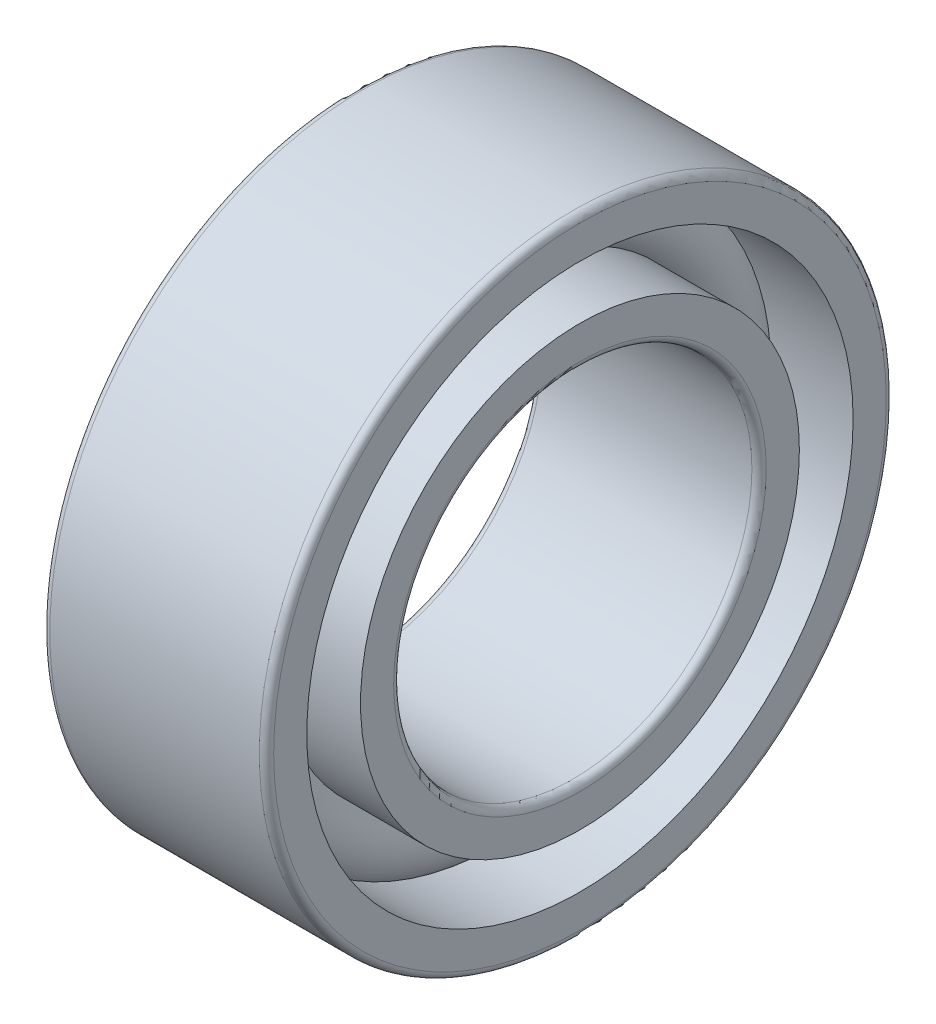
ISO-10303-21;
HEADER;
FILE_DESCRIPTION(('STEP AP214'),'2;1');
FILE_NAME('part.step','',(''),(''),'','','');
FILE_SCHEMA(('AUTOMOTIVE_DESIGN { 1 0 10303 214 1 1 1 1 }'));
ENDSEC;
DATA;
#1=APPLICATION_CONTEXT('core data for automotive mechanical design processes');
#2=APPLICATION_PROTOCOL_DEFINITION('international standard','automotive_design',2000,#1);
#3=PRODUCT_CONTEXT('',#1,'mechanical');
#4=PRODUCT('Part','Part','',(#3));
#5=PRODUCT_RELATED_PRODUCT_CATEGORY('part','',(#4));
#6=PRODUCT_DEFINITION_FORMATION('','',#4);
#7=PRODUCT_DEFINITION_CONTEXT('part definition',#1,'design');
#8=PRODUCT_DEFINITION('design','',#6,#7);
#9=PRODUCT_DEFINITION_SHAPE('','',#8);
#10=(LENGTH_UNIT() NAMED_UNIT(*) SI_UNIT(.MILLI.,.METRE.));
#11=(NAMED_UNIT(*) PLANE_ANGLE_UNIT() SI_UNIT($,.RADIAN.));
#12=(NAMED_UNIT(*) SI_UNIT($,.STERADIAN.) SOLID_ANGLE_UNIT());
#13=UNCERTAINTY_MEASURE_WITH_UNIT(LENGTH_MEASURE(1.E-05),#10,'distance_accuracy_value','');
#14=(GEOMETRIC_REPRESENTATION_CONTEXT(3) GLOBAL_UNCERTAINTY_ASSIGNED_CONTEXT((#13)) GLOBAL_UNIT_ASSIGNED_CONTEXT((#10,
#11,#12)) REPRESENTATION_CONTEXT('',''));
#15=CARTESIAN_POINT('',(0.,0.,0.));
#16=DIRECTION('',(0.,0.,1.));
#17=DIRECTION('',(1.,0.,0.));
#18=AXIS2_PLACEMENT_3D('',#15,#16,#17);
#19=CARTESIAN_POINT('',(-20.6375,0.,0.));
#20=DIRECTION('',(1.,0.,0.));
#21=DIRECTION('',(0.,0.,-1.));
#22=AXIS2_PLACEMENT_3D('',#19,#20,#21);
#23=CYLINDRICAL_SURFACE('',#22,2.);
#24=CARTESIAN_POINT('',(1.17,0.,0.));
#25=DIRECTION('',(1.,0.,0.));
#26=DIRECTION('',(0.,0.,-1.));
#27=AXIS2_PLACEMENT_3D('',#24,#25,#26);
#28=CIRCLE('',#27,2.);
#29=CARTESIAN_POINT('',(1.17,0.,-2.));
#30=VERTEX_POINT('',#29);
#31=EDGE_CURVE('E67',#30,#30,#28,.F.);
#32=ORIENTED_EDGE('',*,*,#31,.F.);
#33=EDGE_LOOP('',(#32));
#34=FACE_BOUND('',#33,.T.);
#35=CARTESIAN_POINT('',(-1.17,0.,0.));
#36=DIRECTION('',(1.,0.,0.));
#37=DIRECTION('',(0.,0.,-1.));
#38=AXIS2_PLACEMENT_3D('',#35,#36,#37);
#39=CIRCLE('',#38,2.);
#40=CARTESIAN_POINT('',(-1.17,0.,-2.));
#41=VERTEX_POINT('',#40);
#42=EDGE_CURVE('E130',#41,#41,#39,.T.);
#43=ORIENTED_EDGE('',*,*,#42,.F.);
#44=EDGE_LOOP('',(#43));
#45=FACE_BOUND('',#44,.T.);
#46=ADVANCED_FACE('F16',(#34,#45),#23,.F.);
#47=CARTESIAN_POINT('',(-1.17,0.,0.));
#48=DIRECTION('',(1.,0.,0.));
#49=DIRECTION('',(0.,0.,-1.));
#50=AXIS2_PLACEMENT_3D('',#47,#48,#49);
#51=TOROIDAL_SURFACE('',#50,2.08,0.08);
#52=ORIENTED_EDGE('',*,*,#42,.T.);
#53=EDGE_LOOP('',(#52));
#54=FACE_BOUND('',#53,.T.);
#55=CARTESIAN_POINT('',(-1.25,0.,0.));
#56=DIRECTION('',(-1.,0.,0.));
#57=DIRECTION('',(0.,0.,-1.));
#58=AXIS2_PLACEMENT_3D('',#55,#56,#57);
#59=CIRCLE('',#58,2.08);
#60=CARTESIAN_POINT('',(-1.25,0.,2.08));
#61=VERTEX_POINT('',#60);
#62=CARTESIAN_POINT('',(-1.25,0.,-2.08));
#63=VERTEX_POINT('',#62);
#64=EDGE_CURVE('E57',#61,#63,#59,.F.);
#65=ORIENTED_EDGE('',*,*,#64,.F.);
#66=CARTESIAN_POINT('',(-1.25,0.,0.));
#67=DIRECTION('',(-1.,0.,0.));
#68=DIRECTION('',(0.,0.,1.));
#69=AXIS2_PLACEMENT_3D('',#66,#67,#68);
#70=CIRCLE('',#69,2.08);
#71=EDGE_CURVE('E55',#63,#61,#70,.F.);
#72=ORIENTED_EDGE('',*,*,#71,.F.);
#73=EDGE_LOOP('',(#65,#72));
#74=FACE_BOUND('',#73,.T.);
#75=ADVANCED_FACE('F59',(#54,#74),#51,.T.);
#76=CARTESIAN_POINT('',(1.17,0.,0.));
#77=DIRECTION('',(1.,0.,0.));
#78=DIRECTION('',(0.,0.,-1.));
#79=AXIS2_PLACEMENT_3D('',#76,#77,#78);
#80=TOROIDAL_SURFACE('',#79,2.08,0.08);
#81=CARTESIAN_POINT('',(1.25,0.,0.));
#82=DIRECTION('',(1.,0.,0.));
#83=DIRECTION('',(0.,0.,-1.));
#84=AXIS2_PLACEMENT_3D('',#81,#82,#83);
#85=CIRCLE('',#84,2.08);
#86=CARTESIAN_POINT('',(1.25,0.,2.08));
#87=VERTEX_POINT('',#86);
#88=CARTESIAN_POINT('',(1.25,0.,-2.08));
#89=VERTEX_POINT('',#88);
#90=EDGE_CURVE('E62',#87,#89,#85,.F.);
#91=ORIENTED_EDGE('',*,*,#90,.F.);
#92=CARTESIAN_POINT('',(1.25,0.,0.));
#93=DIRECTION('',(1.,0.,0.));
#94=DIRECTION('',(0.,0.,1.));
#95=AXIS2_PLACEMENT_3D('',#92,#93,#94);
#96=CIRCLE('',#95,2.08);
#97=EDGE_CURVE('E106',#89,#87,#96,.F.);
#98=ORIENTED_EDGE('',*,*,#97,.F.);
#99=EDGE_LOOP('',(#91,#98));
#100=FACE_BOUND('',#99,.T.);
#101=ORIENTED_EDGE('',*,*,#31,.T.);
#102=EDGE_LOOP('',(#101));
#103=FACE_BOUND('',#102,.T.);
#104=ADVANCED_FACE('F87',(#100,#103),#80,.T.);
#105=CARTESIAN_POINT('',(-1.25,2.45,0.));
#106=DIRECTION('',(-1.,0.,0.));
#107=DIRECTION('',(0.,0.,1.));
#108=AXIS2_PLACEMENT_3D('',#105,#106,#107);
#109=PLANE('',#108);
#110=CARTESIAN_POINT('',(-1.25,0.,0.));
#111=DIRECTION('',(1.,0.,0.));
#112=DIRECTION('',(0.,0.,-1.));
#113=AXIS2_PLACEMENT_3D('',#110,#111,#112);
#114=CIRCLE('',#113,2.45);
#115=CARTESIAN_POINT('',(-1.25,0.,-2.45));
#116=VERTEX_POINT('',#115);
#117=EDGE_CURVE('E145',#116,#116,#114,.T.);
#118=ORIENTED_EDGE('',*,*,#117,.F.);
#119=EDGE_LOOP('',(#118));
#120=FACE_BOUND('',#119,.T.);
#121=ORIENTED_EDGE('',*,*,#71,.T.);
#122=ORIENTED_EDGE('',*,*,#64,.T.);
#123=EDGE_LOOP('',(#121,#122));
#124=FACE_BOUND('',#123,.T.);
#125=ADVANCED_FACE('F66',(#120,#124),#109,.T.);
#126=CARTESIAN_POINT('',(1.25,2.08,0.));
#127=DIRECTION('',(1.,0.,0.));
#128=DIRECTION('',(0.,0.,-1.));
#129=AXIS2_PLACEMENT_3D('',#126,#127,#128);
#130=PLANE('',#129);
#131=ORIENTED_EDGE('',*,*,#90,.T.);
#132=ORIENTED_EDGE('',*,*,#97,.T.);
#133=EDGE_LOOP('',(#131,#132));
#134=FACE_BOUND('',#133,.T.);
#135=CARTESIAN_POINT('',(1.25,0.,0.));
#136=DIRECTION('',(1.,0.,0.));
#137=DIRECTION('',(0.,0.,-1.));
#138=AXIS2_PLACEMENT_3D('',#135,#136,#137);
#139=CIRCLE('',#138,2.45);
#140=CARTESIAN_POINT('',(1.25,0.,-2.45));
#141=VERTEX_POINT('',#140);
#142=EDGE_CURVE('E141',#141,#141,#139,.F.);
#143=ORIENTED_EDGE('',*,*,#142,.F.);
#144=EDGE_LOOP('',(#143));
#145=FACE_BOUND('',#144,.T.);
#146=ADVANCED_FACE('F86',(#134,#145),#130,.T.);
#147=CARTESIAN_POINT('',(-20.6375,0.,0.));
#148=DIRECTION('',(1.,0.,0.));
#149=DIRECTION('',(0.,0.,-1.));
#150=AXIS2_PLACEMENT_3D('',#147,#148,#149);
#151=CYLINDRICAL_SURFACE('',#150,2.45);
#152=ORIENTED_EDGE('',*,*,#117,.T.);
#153=EDGE_LOOP('',(#152));
#154=FACE_BOUND('',#153,.T.);
#155=CARTESIAN_POINT('',(-0.335410196624968,0.,0.));
#156=DIRECTION('',(-1.,0.,0.));
#157=DIRECTION('',(0.,0.,1.));
#158=AXIS2_PLACEMENT_3D('',#155,#156,#157);
#159=CIRCLE('',#158,2.45);
#160=CARTESIAN_POINT('',(-0.335410196624968,0.,2.45));
#161=VERTEX_POINT('',#160);
#162=EDGE_CURVE('E144',#161,#161,#159,.F.);
#163=ORIENTED_EDGE('',*,*,#162,.F.);
#164=EDGE_LOOP('',(#163));
#165=FACE_BOUND('',#164,.T.);
#166=ADVANCED_FACE('F279',(#154,#165),#151,.T.);
#167=CARTESIAN_POINT('',(-20.6375,0.,0.));
#168=DIRECTION('',(1.,0.,0.));
#169=DIRECTION('',(0.,0.,-1.));
#170=AXIS2_PLACEMENT_3D('',#167,#168,#169);
#171=CYLINDRICAL_SURFACE('',#170,2.45);
#172=CARTESIAN_POINT('',(0.335410196624968,0.,0.));
#173=DIRECTION('',(-1.,0.,0.));
#174=DIRECTION('',(0.,0.,1.));
#175=AXIS2_PLACEMENT_3D('',#172,#173,#174);
#176=CIRCLE('',#175,2.45);
#177=CARTESIAN_POINT('',(0.335410196624968,0.,2.45));
#178=VERTEX_POINT('',#177);
#179=EDGE_CURVE('E263',#178,#178,#176,.T.);
#180=ORIENTED_EDGE('',*,*,#179,.F.);
#181=EDGE_LOOP('',(#180));
#182=FACE_BOUND('',#181,.T.);
#183=ORIENTED_EDGE('',*,*,#142,.T.);
#184=EDGE_LOOP('',(#183));
#185=FACE_BOUND('',#184,.T.);
#186=ADVANCED_FACE('F258',(#182,#185),#171,.T.);
#187=CARTESIAN_POINT('',(0.,0.,0.));
#188=DIRECTION('',(-1.,0.,0.));
#189=DIRECTION('',(0.,0.,1.));
#190=AXIS2_PLACEMENT_3D('',#187,#188,#189);
#191=TOROIDAL_SURFACE('',#190,2.75,0.45);
#192=CARTESIAN_POINT('',(-0.335410196624964,0.,0.));
#193=DIRECTION('',(1.,0.,0.));
#194=DIRECTION('',(0.,0.,-1.));
#195=AXIS2_PLACEMENT_3D('',#192,#193,#194);
#196=CIRCLE('',#195,3.05000000000001);
#197=CARTESIAN_POINT('',(-0.335410196624964,0.,-3.05000000000001));
#198=VERTEX_POINT('',#197);
#199=EDGE_CURVE('E262',#198,#198,#196,.F.);
#200=ORIENTED_EDGE('',*,*,#199,.T.);
#201=EDGE_LOOP('',(#200));
#202=FACE_BOUND('',#201,.T.);
#203=ORIENTED_EDGE('',*,*,#162,.T.);
#204=EDGE_LOOP('',(#203));
#205=FACE_BOUND('',#204,.T.);
#206=ADVANCED_FACE('F253',(#202,#205),#191,.T.);
#207=CARTESIAN_POINT('',(0.,0.,0.));
#208=DIRECTION('',(-1.,0.,0.));
#209=DIRECTION('',(0.,0.,1.));
#210=AXIS2_PLACEMENT_3D('',#207,#208,#209);
#211=TOROIDAL_SURFACE('',#210,2.75,0.45);
#212=ORIENTED_EDGE('',*,*,#179,.T.);
#213=EDGE_LOOP('',(#212));
#214=FACE_BOUND('',#213,.T.);
#215=CARTESIAN_POINT('',(0.335410196624964,0.,0.));
#216=DIRECTION('',(1.,0.,0.));
#217=DIRECTION('',(0.,0.,-1.));
#218=AXIS2_PLACEMENT_3D('',#215,#216,#217);
#219=CIRCLE('',#218,3.05000000000001);
#220=CARTESIAN_POINT('',(0.335410196624964,0.,-3.05000000000001));
#221=VERTEX_POINT('',#220);
#222=EDGE_CURVE('E140',#221,#221,#219,.T.);
#223=ORIENTED_EDGE('',*,*,#222,.T.);
#224=EDGE_LOOP('',(#223));
#225=FACE_BOUND('',#224,.T.);
#226=ADVANCED_FACE('F248',(#214,#225),#211,.T.);
#227=CARTESIAN_POINT('',(-20.6375,0.,0.));
#228=DIRECTION('',(1.,0.,0.));
#229=DIRECTION('',(0.,0.,-1.));
#230=AXIS2_PLACEMENT_3D('',#227,#228,#229);
#231=CYLINDRICAL_SURFACE('',#230,3.05000000000001);
#232=ORIENTED_EDGE('',*,*,#199,.F.);
#233=EDGE_LOOP('',(#232));
#234=FACE_BOUND('',#233,.T.);
#235=CARTESIAN_POINT('',(-1.25,0.,0.));
#236=DIRECTION('',(1.,0.,0.));
#237=DIRECTION('',(0.,0.,-1.));
#238=AXIS2_PLACEMENT_3D('',#235,#236,#237);
#239=CIRCLE('',#238,3.05000000000001);
#240=CARTESIAN_POINT('',(-1.25,0.,-3.05000000000001));
#241=VERTEX_POINT('',#240);
#242=EDGE_CURVE('E137',#241,#241,#239,.T.);
#243=ORIENTED_EDGE('',*,*,#242,.F.);
#244=EDGE_LOOP('',(#243));
#245=FACE_BOUND('',#244,.T.);
#246=ADVANCED_FACE('F252',(#234,#245),#231,.F.);
#247=CARTESIAN_POINT('',(-20.6375,0.,0.));
#248=DIRECTION('',(1.,0.,0.));
#249=DIRECTION('',(0.,0.,-1.));
#250=AXIS2_PLACEMENT_3D('',#247,#248,#249);
#251=CYLINDRICAL_SURFACE('',#250,3.05000000000001);
#252=CARTESIAN_POINT('',(1.25,0.,0.));
#253=DIRECTION('',(1.,0.,0.));
#254=DIRECTION('',(0.,0.,-1.));
#255=AXIS2_PLACEMENT_3D('',#252,#253,#254);
#256=CIRCLE('',#255,3.05000000000001);
#257=CARTESIAN_POINT('',(1.25,0.,-3.05000000000001));
#258=VERTEX_POINT('',#257);
#259=EDGE_CURVE('E133',#258,#258,#256,.F.);
#260=ORIENTED_EDGE('',*,*,#259,.F.);
#261=EDGE_LOOP('',(#260));
#262=FACE_BOUND('',#261,.T.);
#263=ORIENTED_EDGE('',*,*,#222,.F.);
#264=EDGE_LOOP('',(#263));
#265=FACE_BOUND('',#264,.T.);
#266=ADVANCED_FACE('F335',(#262,#265),#251,.F.);
#267=CARTESIAN_POINT('',(-1.25,3.05000000000001,0.));
#268=DIRECTION('',(-1.,0.,0.));
#269=DIRECTION('',(0.,0.,1.));
#270=AXIS2_PLACEMENT_3D('',#267,#268,#269);
#271=PLANE('',#270);
#272=CARTESIAN_POINT('',(-1.25,0.,0.));
#273=DIRECTION('',(1.,0.,0.));
#274=DIRECTION('',(0.,0.,-1.));
#275=AXIS2_PLACEMENT_3D('',#272,#273,#274);
#276=CIRCLE('',#275,3.42000000000001);
#277=CARTESIAN_POINT('',(-1.25,0.,-3.42000000000001));
#278=VERTEX_POINT('',#277);
#279=CARTESIAN_POINT('',(-1.25,0.,3.42000000000001));
#280=VERTEX_POINT('',#279);
#281=EDGE_CURVE('E216',#278,#280,#276,.T.);
#282=ORIENTED_EDGE('',*,*,#281,.F.);
#283=CARTESIAN_POINT('',(-1.25,0.,0.));
#284=DIRECTION('',(1.,0.,0.));
#285=DIRECTION('',(0.,0.,1.));
#286=AXIS2_PLACEMENT_3D('',#283,#284,#285);
#287=CIRCLE('',#286,3.42000000000001);
#288=EDGE_CURVE('E136',#280,#278,#287,.T.);
#289=ORIENTED_EDGE('',*,*,#288,.F.);
#290=EDGE_LOOP('',(#282,#289));
#291=FACE_BOUND('',#290,.T.);
#292=ORIENTED_EDGE('',*,*,#242,.T.);
#293=EDGE_LOOP('',(#292));
#294=FACE_BOUND('',#293,.T.);
#295=ADVANCED_FACE('F192',(#291,#294),#271,.T.);
#296=CARTESIAN_POINT('',(1.25,3.42000000000001,0.));
#297=DIRECTION('',(1.,0.,0.));
#298=DIRECTION('',(0.,0.,-1.));
#299=AXIS2_PLACEMENT_3D('',#296,#297,#298);
#300=PLANE('',#299);
#301=ORIENTED_EDGE('',*,*,#259,.T.);
#302=EDGE_LOOP('',(#301));
#303=FACE_BOUND('',#302,.T.);
#304=CARTESIAN_POINT('',(1.25,0.,0.));
#305=DIRECTION('',(-1.,0.,0.));
#306=DIRECTION('',(0.,0.,1.));
#307=AXIS2_PLACEMENT_3D('',#304,#305,#306);
#308=CIRCLE('',#307,3.42000000000001);
#309=CARTESIAN_POINT('',(1.25,0.,3.42000000000001));
#310=VERTEX_POINT('',#309);
#311=CARTESIAN_POINT('',(1.25,0.,-3.42000000000001));
#312=VERTEX_POINT('',#311);
#313=EDGE_CURVE('E179',#310,#312,#308,.T.);
#314=ORIENTED_EDGE('',*,*,#313,.F.);
#315=CARTESIAN_POINT('',(1.25,0.,0.));
#316=DIRECTION('',(-1.,0.,0.));
#317=DIRECTION('',(0.,0.,-1.));
#318=AXIS2_PLACEMENT_3D('',#315,#316,#317);
#319=CIRCLE('',#318,3.42000000000001);
#320=EDGE_CURVE('E34',#312,#310,#319,.T.);
#321=ORIENTED_EDGE('',*,*,#320,.F.);
#322=EDGE_LOOP('',(#314,#321));
#323=FACE_BOUND('',#322,.T.);
#324=ADVANCED_FACE('F183',(#303,#323),#300,.T.);
#325=CARTESIAN_POINT('',(-1.17,0.,0.));
#326=DIRECTION('',(1.,0.,0.));
#327=DIRECTION('',(0.,0.,-1.));
#328=AXIS2_PLACEMENT_3D('',#325,#326,#327);
#329=TOROIDAL_SURFACE('',#328,3.42000000000001,0.0800000000000009);
#330=CARTESIAN_POINT('',(-1.17,0.,0.));
#331=DIRECTION('',(1.,0.,0.));
#332=DIRECTION('',(0.,0.,-1.));
#333=AXIS2_PLACEMENT_3D('',#330,#331,#332);
#334=CIRCLE('',#333,3.50000000000001);
#335=CARTESIAN_POINT('',(-1.17,0.,-3.50000000000001));
#336=VERTEX_POINT('',#335);
#337=EDGE_CURVE('E26',#336,#336,#334,.T.);
#338=ORIENTED_EDGE('',*,*,#337,.F.);
#339=EDGE_LOOP('',(#338));
#340=FACE_BOUND('',#339,.T.);
#341=ORIENTED_EDGE('',*,*,#281,.T.);
#342=ORIENTED_EDGE('',*,*,#288,.T.);
#343=EDGE_LOOP('',(#341,#342));
#344=FACE_BOUND('',#343,.T.);
#345=ADVANCED_FACE('F168',(#340,#344),#329,.T.);
#346=CARTESIAN_POINT('',(1.17,0.,0.));
#347=DIRECTION('',(1.,0.,0.));
#348=DIRECTION('',(0.,0.,-1.));
#349=AXIS2_PLACEMENT_3D('',#346,#347,#348);
#350=TOROIDAL_SURFACE('',#349,3.42000000000001,0.0800000000000009);
#351=ORIENTED_EDGE('',*,*,#320,.T.);
#352=ORIENTED_EDGE('',*,*,#313,.T.);
#353=EDGE_LOOP('',(#351,#352));
#354=FACE_BOUND('',#353,.T.);
#355=CARTESIAN_POINT('',(1.17,0.,0.));
#356=DIRECTION('',(1.,0.,0.));
#357=DIRECTION('',(0.,0.,-1.));
#358=AXIS2_PLACEMENT_3D('',#355,#356,#357);
#359=CIRCLE('',#358,3.50000000000001);
#360=CARTESIAN_POINT('',(1.17,0.,-3.50000000000001));
#361=VERTEX_POINT('',#360);
#362=EDGE_CURVE('E11',#361,#361,#359,.F.);
#363=ORIENTED_EDGE('',*,*,#362,.F.);
#364=EDGE_LOOP('',(#363));
#365=FACE_BOUND('',#364,.T.);
#366=ADVANCED_FACE('F156',(#354,#365),#350,.T.);
#367=CARTESIAN_POINT('',(-20.6375,0.,0.));
#368=DIRECTION('',(1.,0.,0.));
#369=DIRECTION('',(0.,0.,-1.));
#370=AXIS2_PLACEMENT_3D('',#367,#368,#369);
#371=CYLINDRICAL_SURFACE('',#370,3.50000000000001);
#372=ORIENTED_EDGE('',*,*,#362,.T.);
#373=EDGE_LOOP('',(#372));
#374=FACE_BOUND('',#373,.T.);
#375=ORIENTED_EDGE('',*,*,#337,.T.);
#376=EDGE_LOOP('',(#375));
#377=FACE_BOUND('',#376,.T.);
#378=ADVANCED_FACE('F167',(#374,#377),#371,.T.);
#379=CLOSED_SHELL('',(#46,#75,#104,#125,#146,#166,#186,#206,#226,#246,#266,#295,#324,#345,#366,#378));
#380=MANIFOLD_SOLID_BREP('B1',#379);
#381=ADVANCED_BREP_SHAPE_REPRESENTATION('',(#18,#380),#14);
#382=SHAPE_DEFINITION_REPRESENTATION(#9,#381);
ENDSEC;
END-ISO-10303-21;
